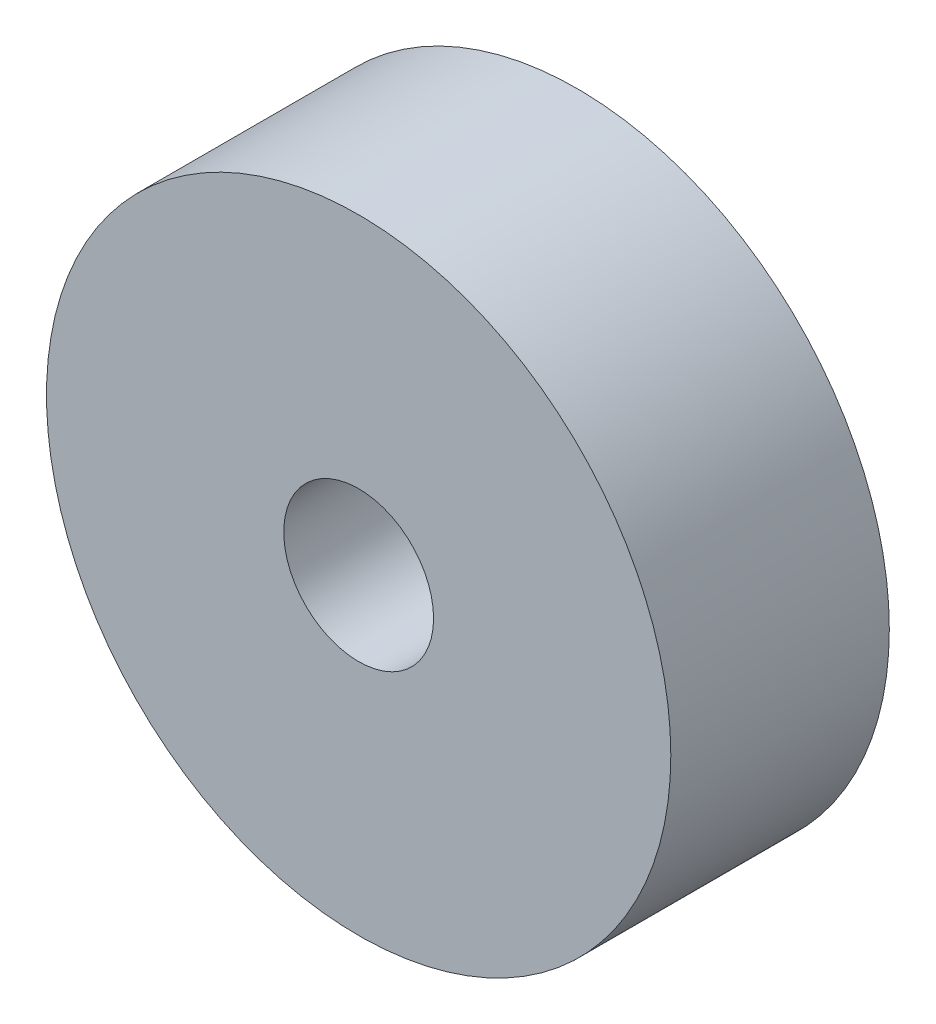
ISO-10303-21;
HEADER;
FILE_DESCRIPTION(('STEP AP214'),'2;1');
FILE_NAME('part.step','',(''),(''),'','','');
FILE_SCHEMA(('AUTOMOTIVE_DESIGN { 1 0 10303 214 1 1 1 1 }'));
ENDSEC;
DATA;
#1=APPLICATION_CONTEXT('core data for automotive mechanical design processes');
#2=APPLICATION_PROTOCOL_DEFINITION('international standard','automotive_design',2000,#1);
#3=PRODUCT_CONTEXT('',#1,'mechanical');
#4=PRODUCT('Part','Part','',(#3));
#5=PRODUCT_RELATED_PRODUCT_CATEGORY('part','',(#4));
#6=PRODUCT_DEFINITION_FORMATION('','',#4);
#7=PRODUCT_DEFINITION_CONTEXT('part definition',#1,'design');
#8=PRODUCT_DEFINITION('design','',#6,#7);
#9=PRODUCT_DEFINITION_SHAPE('','',#8);
#10=(LENGTH_UNIT() NAMED_UNIT(*) SI_UNIT(.MILLI.,.METRE.));
#11=(NAMED_UNIT(*) PLANE_ANGLE_UNIT() SI_UNIT($,.RADIAN.));
#12=(NAMED_UNIT(*) SI_UNIT($,.STERADIAN.) SOLID_ANGLE_UNIT());
#13=UNCERTAINTY_MEASURE_WITH_UNIT(LENGTH_MEASURE(1.E-05),#10,'distance_accuracy_value','');
#14=(GEOMETRIC_REPRESENTATION_CONTEXT(3) GLOBAL_UNCERTAINTY_ASSIGNED_CONTEXT((#13)) GLOBAL_UNIT_ASSIGNED_CONTEXT((#10,
#11,#12)) REPRESENTATION_CONTEXT('',''));
#15=CARTESIAN_POINT('',(0.,0.,0.));
#16=DIRECTION('',(0.,0.,1.));
#17=DIRECTION('',(1.,0.,0.));
#18=AXIS2_PLACEMENT_3D('',#15,#16,#17);
#19=CARTESIAN_POINT('',(7.20439152004204,-7.8054276100069,-1.8));
#20=DIRECTION('',(0.,0.,1.));
#21=DIRECTION('',(1.,0.,0.));
#22=AXIS2_PLACEMENT_3D('',#19,#20,#21);
#23=PLANE('',#22);
#24=CARTESIAN_POINT('',(7.08439152004204,-7.8054276100069,-1.8));
#25=DIRECTION('',(0.,0.,1.));
#26=DIRECTION('',(1.,0.,0.));
#27=AXIS2_PLACEMENT_3D('',#24,#25,#26);
#28=CIRCLE('',#27,0.499999999999998);
#29=CARTESIAN_POINT('',(7.58439152004204,-7.8054276100069,-1.8));
#30=VERTEX_POINT('',#29);
#31=EDGE_CURVE('E52',#30,#30,#28,.T.);
#32=ORIENTED_EDGE('',*,*,#31,.T.);
#33=EDGE_LOOP('',(#32));
#34=FACE_BOUND('',#33,.T.);
#35=CARTESIAN_POINT('',(7.08439152004204,-7.8054276100069,-1.8));
#36=DIRECTION('',(0.,0.,1.));
#37=DIRECTION('',(1.,0.,0.));
#38=AXIS2_PLACEMENT_3D('',#35,#36,#37);
#39=CIRCLE('',#38,0.119999999999999);
#40=CARTESIAN_POINT('',(7.20439152004204,-7.8054276100069,-1.8));
#41=VERTEX_POINT('',#40);
#42=EDGE_CURVE('E10',#41,#41,#39,.T.);
#43=ORIENTED_EDGE('',*,*,#42,.F.);
#44=EDGE_LOOP('',(#43));
#45=FACE_BOUND('',#44,.T.);
#46=ADVANCED_FACE('F30',(#34,#45),#23,.T.);
#47=CARTESIAN_POINT('',(7.08439152004204,-7.8054276100069,-2.15));
#48=DIRECTION('',(0.,0.,1.));
#49=DIRECTION('',(1.,0.,0.));
#50=AXIS2_PLACEMENT_3D('',#47,#48,#49);
#51=CYLINDRICAL_SURFACE('',#50,0.119999999999999);
#52=ORIENTED_EDGE('',*,*,#42,.T.);
#53=EDGE_LOOP('',(#52));
#54=FACE_BOUND('',#53,.T.);
#55=CARTESIAN_POINT('',(7.08439152004204,-7.8054276100069,-2.1));
#56=DIRECTION('',(0.,0.,1.));
#57=DIRECTION('',(1.,0.,0.));
#58=AXIS2_PLACEMENT_3D('',#55,#56,#57);
#59=CIRCLE('',#58,0.119999999999999);
#60=CARTESIAN_POINT('',(7.20439152004204,-7.8054276100069,-2.1));
#61=VERTEX_POINT('',#60);
#62=EDGE_CURVE('E36',#61,#61,#59,.T.);
#63=ORIENTED_EDGE('',*,*,#62,.F.);
#64=EDGE_LOOP('',(#63));
#65=FACE_BOUND('',#64,.T.);
#66=ADVANCED_FACE('F70',(#54,#65),#51,.F.);
#67=CARTESIAN_POINT('',(7.21856028052427,-7.8054276100069,-2.1));
#68=DIRECTION('',(0.,0.,-1.));
#69=DIRECTION('',(-1.,0.,0.));
#70=AXIS2_PLACEMENT_3D('',#67,#68,#69);
#71=PLANE('',#70);
#72=ORIENTED_EDGE('',*,*,#62,.T.);
#73=EDGE_LOOP('',(#72));
#74=FACE_BOUND('',#73,.T.);
#75=CARTESIAN_POINT('',(7.08439152004204,-7.8054276100069,-2.1));
#76=DIRECTION('',(0.,0.,1.));
#77=DIRECTION('',(1.,0.,0.));
#78=AXIS2_PLACEMENT_3D('',#75,#76,#77);
#79=CIRCLE('',#78,0.13416876048223);
#80=CARTESIAN_POINT('',(7.21856028052427,-7.8054276100069,-2.1));
#81=VERTEX_POINT('',#80);
#82=EDGE_CURVE('E40',#81,#81,#79,.T.);
#83=ORIENTED_EDGE('',*,*,#82,.F.);
#84=EDGE_LOOP('',(#83));
#85=FACE_BOUND('',#84,.T.);
#86=ADVANCED_FACE('F74',(#74,#85),#71,.T.);
#87=CARTESIAN_POINT('',(7.08439152004204,-7.8054276100069,-2.4));
#88=DIRECTION('',(0.,0.,1.));
#89=DIRECTION('',(1.,0.,0.));
#90=AXIS2_PLACEMENT_3D('',#87,#88,#89);
#91=DEGENERATE_TOROIDAL_SURFACE('',#90,0.13416876048223,0.3,.T.);
#92=ORIENTED_EDGE('',*,*,#82,.T.);
#93=EDGE_LOOP('',(#92));
#94=FACE_BOUND('',#93,.T.);
#95=CARTESIAN_POINT('',(7.08439152004204,-7.8054276100069,-2.15));
#96=DIRECTION('',(0.,0.,1.));
#97=DIRECTION('',(1.,0.,0.));
#98=AXIS2_PLACEMENT_3D('',#95,#96,#97);
#99=CIRCLE('',#98,0.3);
#100=CARTESIAN_POINT('',(7.38439152004204,-7.8054276100069,-2.15));
#101=VERTEX_POINT('',#100);
#102=EDGE_CURVE('E44',#101,#101,#99,.T.);
#103=ORIENTED_EDGE('',*,*,#102,.F.);
#104=EDGE_LOOP('',(#103));
#105=FACE_BOUND('',#104,.T.);
#106=ADVANCED_FACE('F66',(#94,#105),#91,.F.);
#107=CARTESIAN_POINT('',(7.58439152004204,-7.8054276100069,-2.15));
#108=DIRECTION('',(0.,0.,-1.));
#109=DIRECTION('',(-1.,0.,0.));
#110=AXIS2_PLACEMENT_3D('',#107,#108,#109);
#111=PLANE('',#110);
#112=ORIENTED_EDGE('',*,*,#102,.T.);
#113=EDGE_LOOP('',(#112));
#114=FACE_BOUND('',#113,.T.);
#115=CARTESIAN_POINT('',(7.08439152004204,-7.8054276100069,-2.15));
#116=DIRECTION('',(0.,0.,1.));
#117=DIRECTION('',(1.,0.,0.));
#118=AXIS2_PLACEMENT_3D('',#115,#116,#117);
#119=CIRCLE('',#118,0.499999999999998);
#120=CARTESIAN_POINT('',(7.58439152004204,-7.8054276100069,-2.15));
#121=VERTEX_POINT('',#120);
#122=EDGE_CURVE('E49',#121,#121,#119,.T.);
#123=ORIENTED_EDGE('',*,*,#122,.F.);
#124=EDGE_LOOP('',(#123));
#125=FACE_BOUND('',#124,.T.);
#126=ADVANCED_FACE('F60',(#114,#125),#111,.T.);
#127=CARTESIAN_POINT('',(7.08439152004204,-7.8054276100069,-2.15));
#128=DIRECTION('',(0.,0.,1.));
#129=DIRECTION('',(1.,0.,0.));
#130=AXIS2_PLACEMENT_3D('',#127,#128,#129);
#131=CYLINDRICAL_SURFACE('',#130,0.499999999999998);
#132=ORIENTED_EDGE('',*,*,#122,.T.);
#133=EDGE_LOOP('',(#132));
#134=FACE_BOUND('',#133,.T.);
#135=ORIENTED_EDGE('',*,*,#31,.F.);
#136=EDGE_LOOP('',(#135));
#137=FACE_BOUND('',#136,.T.);
#138=ADVANCED_FACE('F58',(#134,#137),#131,.T.);
#139=CLOSED_SHELL('',(#46,#66,#86,#106,#126,#138));
#140=MANIFOLD_SOLID_BREP('B2',#139);
#141=ADVANCED_BREP_SHAPE_REPRESENTATION('',(#18,#140),#14);
#142=SHAPE_DEFINITION_REPRESENTATION(#9,#141);
ENDSEC;
END-ISO-10303-21;
